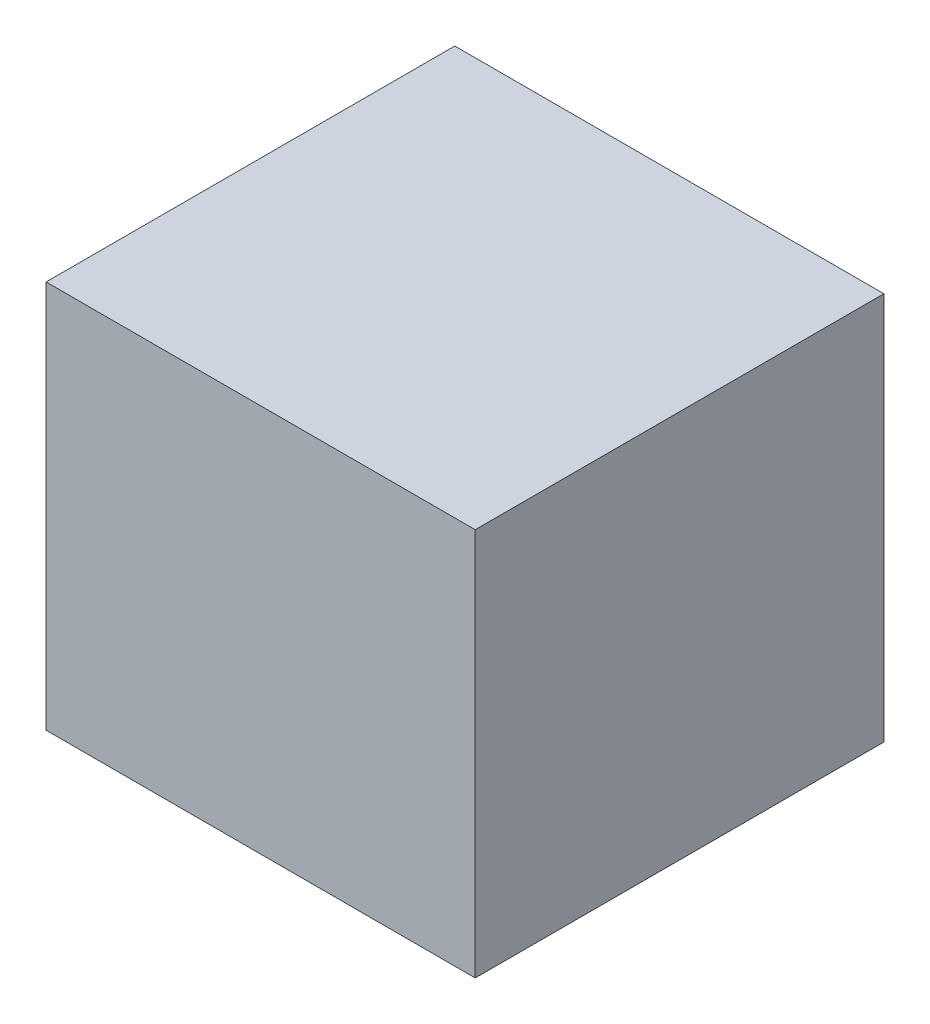
ISO-10303-21;
HEADER;
FILE_DESCRIPTION(('STEP AP214'),'2;1');
FILE_NAME('part.step','',(''),(''),'','','');
FILE_SCHEMA(('AUTOMOTIVE_DESIGN { 1 0 10303 214 1 1 1 1 }'));
ENDSEC;
DATA;
#1=APPLICATION_CONTEXT('core data for automotive mechanical design processes');
#2=APPLICATION_PROTOCOL_DEFINITION('international standard','automotive_design',2000,#1);
#3=PRODUCT_CONTEXT('',#1,'mechanical');
#4=PRODUCT('Part','Part','',(#3));
#5=PRODUCT_RELATED_PRODUCT_CATEGORY('part','',(#4));
#6=PRODUCT_DEFINITION_FORMATION('','',#4);
#7=PRODUCT_DEFINITION_CONTEXT('part definition',#1,'design');
#8=PRODUCT_DEFINITION('design','',#6,#7);
#9=PRODUCT_DEFINITION_SHAPE('','',#8);
#10=(LENGTH_UNIT() NAMED_UNIT(*) SI_UNIT(.MILLI.,.METRE.));
#11=(NAMED_UNIT(*) PLANE_ANGLE_UNIT() SI_UNIT($,.RADIAN.));
#12=(NAMED_UNIT(*) SI_UNIT($,.STERADIAN.) SOLID_ANGLE_UNIT());
#13=UNCERTAINTY_MEASURE_WITH_UNIT(LENGTH_MEASURE(1.E-05),#10,'distance_accuracy_value','');
#14=(GEOMETRIC_REPRESENTATION_CONTEXT(3) GLOBAL_UNCERTAINTY_ASSIGNED_CONTEXT((#13)) GLOBAL_UNIT_ASSIGNED_CONTEXT((#10,
#11,#12)) REPRESENTATION_CONTEXT('',''));
#15=CARTESIAN_POINT('',(0.,0.,0.));
#16=DIRECTION('',(0.,0.,1.));
#17=DIRECTION('',(1.,0.,0.));
#18=AXIS2_PLACEMENT_3D('',#15,#16,#17);
#19=CARTESIAN_POINT('',(-0.52500022,-0.47499778,0.));
#20=DIRECTION('',(0.,1.,0.));
#21=DIRECTION('',(0.,0.,1.));
#22=AXIS2_PLACEMENT_3D('',#19,#20,#21);
#23=PLANE('',#22);
#24=DIRECTION('',(0.,0.,1.));
#25=VECTOR('',#24,1.);
#26=CARTESIAN_POINT('',(0.52500022,-0.47499778,0.));
#27=LINE('',#26,#25);
#28=CARTESIAN_POINT('',(0.52500022,-0.47499778,0.));
#29=VERTEX_POINT('',#28);
#30=CARTESIAN_POINT('',(0.52500022,-0.47499778,1.00000054));
#31=VERTEX_POINT('',#30);
#32=EDGE_CURVE('E20',#29,#31,#27,.T.);
#33=ORIENTED_EDGE('',*,*,#32,.T.);
#34=DIRECTION('',(-1.,0.,0.));
#35=VECTOR('',#34,1.);
#36=CARTESIAN_POINT('',(0.52500022,-0.47499778,1.00000054));
#37=LINE('',#36,#35);
#38=CARTESIAN_POINT('',(-0.52500022,-0.47499778,1.00000054));
#39=VERTEX_POINT('',#38);
#40=EDGE_CURVE('E55',#31,#39,#37,.T.);
#41=ORIENTED_EDGE('',*,*,#40,.T.);
#42=DIRECTION('',(0.,0.,-1.));
#43=VECTOR('',#42,1.);
#44=CARTESIAN_POINT('',(-0.52500022,-0.47499778,0.));
#45=LINE('',#44,#43);
#46=CARTESIAN_POINT('',(-0.52500022,-0.47499778,0.));
#47=VERTEX_POINT('',#46);
#48=EDGE_CURVE('E74',#39,#47,#45,.T.);
#49=ORIENTED_EDGE('',*,*,#48,.T.);
#50=DIRECTION('',(-1.,0.,0.));
#51=VECTOR('',#50,1.);
#52=CARTESIAN_POINT('',(0.52500022,-0.47499778,0.));
#53=LINE('',#52,#51);
#54=EDGE_CURVE('E66',#29,#47,#53,.T.);
#55=ORIENTED_EDGE('',*,*,#54,.F.);
#56=EDGE_LOOP('',(#33,#41,#49,#55));
#57=FACE_BOUND('',#56,.T.);
#58=ADVANCED_FACE('F17',(#57),#23,.F.);
#59=CARTESIAN_POINT('',(0.52500022,-0.47499778,0.));
#60=DIRECTION('',(-1.,0.,0.));
#61=DIRECTION('',(0.,0.,1.));
#62=AXIS2_PLACEMENT_3D('',#59,#60,#61);
#63=PLANE('',#62);
#64=DIRECTION('',(0.,0.,-1.));
#65=VECTOR('',#64,1.);
#66=CARTESIAN_POINT('',(0.52500022,0.47500032,0.));
#67=LINE('',#66,#65);
#68=CARTESIAN_POINT('',(0.52500022,0.47500032,0.));
#69=VERTEX_POINT('',#68);
#70=CARTESIAN_POINT('',(0.52500022,0.47500032,1.00000054));
#71=VERTEX_POINT('',#70);
#72=EDGE_CURVE('E72',#69,#71,#67,.F.);
#73=ORIENTED_EDGE('',*,*,#72,.T.);
#74=DIRECTION('',(0.,1.,0.));
#75=VECTOR('',#74,1.);
#76=CARTESIAN_POINT('',(0.52500022,-0.47499778,1.00000054));
#77=LINE('',#76,#75);
#78=EDGE_CURVE('E62',#71,#31,#77,.F.);
#79=ORIENTED_EDGE('',*,*,#78,.T.);
#80=ORIENTED_EDGE('',*,*,#32,.F.);
#81=DIRECTION('',(0.,1.,0.));
#82=VECTOR('',#81,1.);
#83=CARTESIAN_POINT('',(0.52500022,-0.47499778,0.));
#84=LINE('',#83,#82);
#85=EDGE_CURVE('E80',#69,#29,#84,.F.);
#86=ORIENTED_EDGE('',*,*,#85,.F.);
#87=EDGE_LOOP('',(#73,#79,#80,#86));
#88=FACE_BOUND('',#87,.T.);
#89=ADVANCED_FACE('F71',(#88),#63,.F.);
#90=CARTESIAN_POINT('',(0.52500022,-0.47499778,1.00000054));
#91=DIRECTION('',(0.,0.,-1.));
#92=DIRECTION('',(-1.,0.,0.));
#93=AXIS2_PLACEMENT_3D('',#90,#91,#92);
#94=PLANE('',#93);
#95=DIRECTION('',(1.,0.,0.));
#96=VECTOR('',#95,1.);
#97=CARTESIAN_POINT('',(0.52500022,0.47500032,1.00000054));
#98=LINE('',#97,#96);
#99=CARTESIAN_POINT('',(-0.52500022,0.47500032,1.00000054));
#100=VERTEX_POINT('',#99);
#101=EDGE_CURVE('E83',#71,#100,#98,.F.);
#102=ORIENTED_EDGE('',*,*,#101,.T.);
#103=DIRECTION('',(0.,1.,0.));
#104=VECTOR('',#103,1.);
#105=CARTESIAN_POINT('',(-0.52500022,0.47500032,1.00000054));
#106=LINE('',#105,#104);
#107=EDGE_CURVE('E64',#100,#39,#106,.F.);
#108=ORIENTED_EDGE('',*,*,#107,.T.);
#109=ORIENTED_EDGE('',*,*,#40,.F.);
#110=ORIENTED_EDGE('',*,*,#78,.F.);
#111=EDGE_LOOP('',(#102,#108,#109,#110));
#112=FACE_BOUND('',#111,.T.);
#113=ADVANCED_FACE('F60',(#112),#94,.F.);
#114=CARTESIAN_POINT('',(-0.52500022,0.47500032,0.));
#115=DIRECTION('',(1.,0.,0.));
#116=DIRECTION('',(0.,0.,-1.));
#117=AXIS2_PLACEMENT_3D('',#114,#115,#116);
#118=PLANE('',#117);
#119=ORIENTED_EDGE('',*,*,#48,.F.);
#120=ORIENTED_EDGE('',*,*,#107,.F.);
#121=DIRECTION('',(0.,0.,-1.));
#122=VECTOR('',#121,1.);
#123=CARTESIAN_POINT('',(-0.52500022,0.47500032,0.));
#124=LINE('',#123,#122);
#125=CARTESIAN_POINT('',(-0.52500022,0.47500032,0.));
#126=VERTEX_POINT('',#125);
#127=EDGE_CURVE('E26',#100,#126,#124,.T.);
#128=ORIENTED_EDGE('',*,*,#127,.T.);
#129=DIRECTION('',(0.,1.,0.));
#130=VECTOR('',#129,1.);
#131=CARTESIAN_POINT('',(-0.52500022,-0.47499778,0.));
#132=LINE('',#131,#130);
#133=EDGE_CURVE('E34',#47,#126,#132,.T.);
#134=ORIENTED_EDGE('',*,*,#133,.F.);
#135=EDGE_LOOP('',(#119,#120,#128,#134));
#136=FACE_BOUND('',#135,.T.);
#137=ADVANCED_FACE('F88',(#136),#118,.F.);
#138=CARTESIAN_POINT('',(0.52500022,-0.47499778,0.));
#139=DIRECTION('',(0.,0.,-1.));
#140=DIRECTION('',(-1.,0.,0.));
#141=AXIS2_PLACEMENT_3D('',#138,#139,#140);
#142=PLANE('',#141);
#143=DIRECTION('',(1.,0.,0.));
#144=VECTOR('',#143,1.);
#145=CARTESIAN_POINT('',(0.52500022,0.47500032,0.));
#146=LINE('',#145,#144);
#147=EDGE_CURVE('E11',#126,#69,#146,.T.);
#148=ORIENTED_EDGE('',*,*,#147,.T.);
#149=ORIENTED_EDGE('',*,*,#85,.T.);
#150=ORIENTED_EDGE('',*,*,#54,.T.);
#151=ORIENTED_EDGE('',*,*,#133,.T.);
#152=EDGE_LOOP('',(#148,#149,#150,#151));
#153=FACE_BOUND('',#152,.T.);
#154=ADVANCED_FACE('F91',(#153),#142,.T.);
#155=CARTESIAN_POINT('',(0.52500022,0.47500032,0.));
#156=DIRECTION('',(0.,-1.,0.));
#157=DIRECTION('',(0.,0.,-1.));
#158=AXIS2_PLACEMENT_3D('',#155,#156,#157);
#159=PLANE('',#158);
#160=ORIENTED_EDGE('',*,*,#127,.F.);
#161=ORIENTED_EDGE('',*,*,#101,.F.);
#162=ORIENTED_EDGE('',*,*,#72,.F.);
#163=ORIENTED_EDGE('',*,*,#147,.F.);
#164=EDGE_LOOP('',(#160,#161,#162,#163));
#165=FACE_BOUND('',#164,.T.);
#166=ADVANCED_FACE('F90',(#165),#159,.F.);
#167=CLOSED_SHELL('',(#58,#89,#113,#137,#154,#166));
#168=MANIFOLD_SOLID_BREP('B1',#167);
#169=ADVANCED_BREP_SHAPE_REPRESENTATION('',(#18,#168),#14);
#170=SHAPE_DEFINITION_REPRESENTATION(#9,#169);
ENDSEC;
END-ISO-10303-21;
